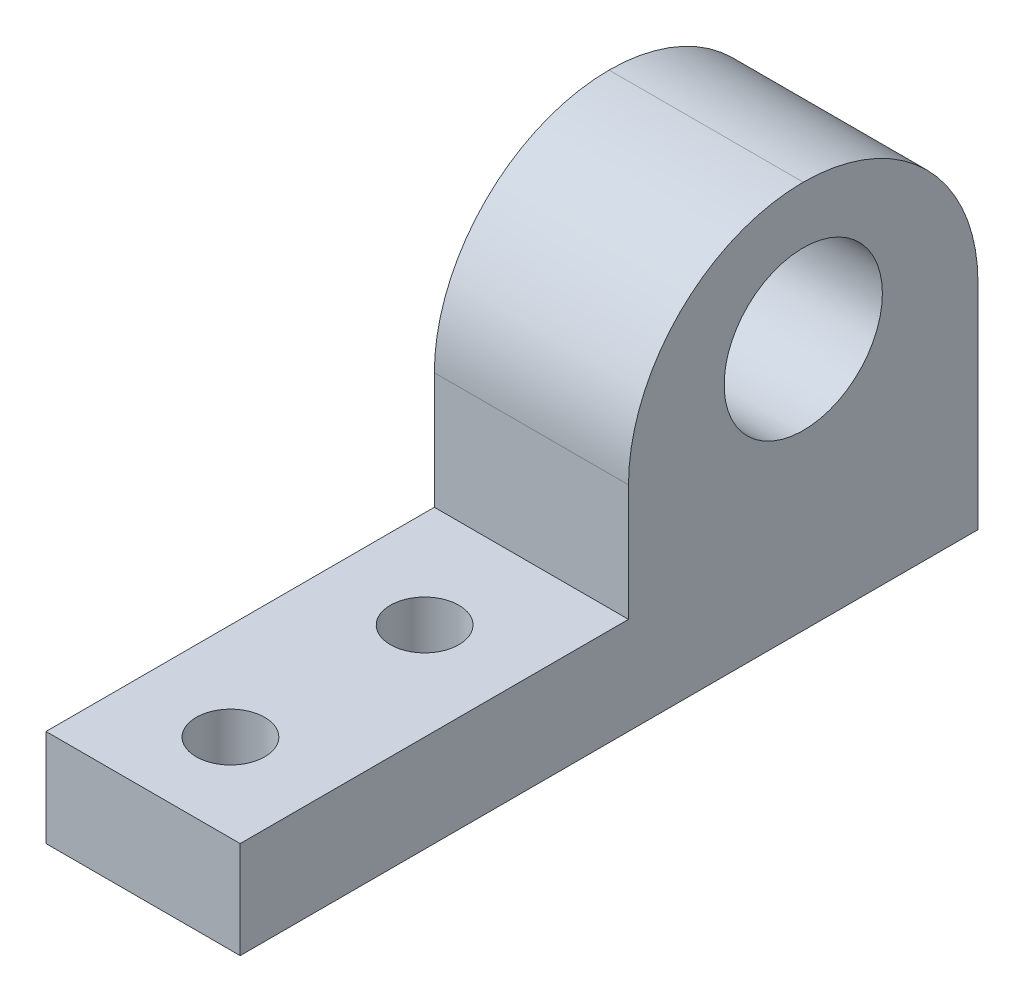
ISO-10303-21;
HEADER;
FILE_DESCRIPTION(('STEP AP214'),'2;1');
FILE_NAME('part.step','',(''),(''),'','','');
FILE_SCHEMA(('AUTOMOTIVE_DESIGN { 1 0 10303 214 1 1 1 1 }'));
ENDSEC;
DATA;
#1=APPLICATION_CONTEXT('core data for automotive mechanical design processes');
#2=APPLICATION_PROTOCOL_DEFINITION('international standard','automotive_design',2000,#1);
#3=PRODUCT_CONTEXT('',#1,'mechanical');
#4=PRODUCT('Part','Part','',(#3));
#5=PRODUCT_RELATED_PRODUCT_CATEGORY('part','',(#4));
#6=PRODUCT_DEFINITION_FORMATION('','',#4);
#7=PRODUCT_DEFINITION_CONTEXT('part definition',#1,'design');
#8=PRODUCT_DEFINITION('design','',#6,#7);
#9=PRODUCT_DEFINITION_SHAPE('','',#8);
#10=(LENGTH_UNIT() NAMED_UNIT(*) SI_UNIT(.MILLI.,.METRE.));
#11=(NAMED_UNIT(*) PLANE_ANGLE_UNIT() SI_UNIT($,.RADIAN.));
#12=(NAMED_UNIT(*) SI_UNIT($,.STERADIAN.) SOLID_ANGLE_UNIT());
#13=UNCERTAINTY_MEASURE_WITH_UNIT(LENGTH_MEASURE(1.E-05),#10,'distance_accuracy_value','');
#14=(GEOMETRIC_REPRESENTATION_CONTEXT(3) GLOBAL_UNCERTAINTY_ASSIGNED_CONTEXT((#13)) GLOBAL_UNIT_ASSIGNED_CONTEXT((#10,
#11,#12)) REPRESENTATION_CONTEXT('',''));
#15=CARTESIAN_POINT('',(0.,0.,0.));
#16=DIRECTION('',(0.,0.,1.));
#17=DIRECTION('',(1.,0.,0.));
#18=AXIS2_PLACEMENT_3D('',#15,#16,#17);
#19=CARTESIAN_POINT('',(0.,5.,0.));
#20=DIRECTION('',(0.,-1.,0.));
#21=DIRECTION('',(0.,0.,-1.));
#22=AXIS2_PLACEMENT_3D('',#19,#20,#21);
#23=PLANE('',#22);
#24=CARTESIAN_POINT('',(-2.1891891891892,5.,16.9054054054054));
#25=DIRECTION('',(0.,1.,0.));
#26=DIRECTION('',(0.,0.,1.));
#27=AXIS2_PLACEMENT_3D('',#24,#25,#26);
#28=CIRCLE('',#27,1.76359605175625);
#29=CARTESIAN_POINT('',(-2.1891891891892,5.,18.6690014571617));
#30=VERTEX_POINT('',#29);
#31=EDGE_CURVE('E122',#30,#30,#28,.T.);
#32=ORIENTED_EDGE('',*,*,#31,.F.);
#33=EDGE_LOOP('',(#32));
#34=FACE_BOUND('',#33,.T.);
#35=CARTESIAN_POINT('',(-2.18918918918919,5.,26.9054054054054));
#36=DIRECTION('',(0.,1.,0.));
#37=DIRECTION('',(0.,0.,1.));
#38=AXIS2_PLACEMENT_3D('',#35,#36,#37);
#39=CIRCLE('',#38,1.76359605175625);
#40=CARTESIAN_POINT('',(-2.18918918918919,5.,28.6690014571617));
#41=VERTEX_POINT('',#40);
#42=EDGE_CURVE('E128',#41,#41,#39,.T.);
#43=ORIENTED_EDGE('',*,*,#42,.F.);
#44=EDGE_LOOP('',(#43));
#45=FACE_BOUND('',#44,.T.);
#46=DIRECTION('',(1.,0.,0.));
#47=VECTOR('',#46,1.);
#48=CARTESIAN_POINT('',(-7.1891891891892,5.,11.4054054054054));
#49=LINE('',#48,#47);
#50=CARTESIAN_POINT('',(-7.1891891891892,5.,11.4054054054054));
#51=VERTEX_POINT('',#50);
#52=CARTESIAN_POINT('',(2.8108108108108,5.,11.4054054054054));
#53=VERTEX_POINT('',#52);
#54=EDGE_CURVE('E103',#51,#53,#49,.T.);
#55=ORIENTED_EDGE('',*,*,#54,.F.);
#56=DIRECTION('',(0.,0.,1.));
#57=VECTOR('',#56,1.);
#58=CARTESIAN_POINT('',(-7.1891891891892,5.,-6.59459459459459));
#59=LINE('',#58,#57);
#60=CARTESIAN_POINT('',(-7.18918918918919,5.,31.4054054054054));
#61=VERTEX_POINT('',#60);
#62=EDGE_CURVE('E134',#51,#61,#59,.T.);
#63=ORIENTED_EDGE('',*,*,#62,.T.);
#64=DIRECTION('',(1.,0.,0.));
#65=VECTOR('',#64,1.);
#66=CARTESIAN_POINT('',(2.8108108108108,5.,31.4054054054054));
#67=LINE('',#66,#65);
#68=CARTESIAN_POINT('',(2.8108108108108,5.,31.4054054054054));
#69=VERTEX_POINT('',#68);
#70=EDGE_CURVE('E109',#61,#69,#67,.T.);
#71=ORIENTED_EDGE('',*,*,#70,.T.);
#72=DIRECTION('',(0.,0.,-1.));
#73=VECTOR('',#72,1.);
#74=CARTESIAN_POINT('',(2.8108108108108,5.,-6.59459459459459));
#75=LINE('',#74,#73);
#76=EDGE_CURVE('E95',#69,#53,#75,.T.);
#77=ORIENTED_EDGE('',*,*,#76,.T.);
#78=EDGE_LOOP('',(#55,#63,#71,#77));
#79=FACE_BOUND('',#78,.T.);
#80=ADVANCED_FACE('F35',(#34,#45,#79),#23,.F.);
#81=CARTESIAN_POINT('',(0.,0.,0.));
#82=DIRECTION('',(0.,-1.,0.));
#83=DIRECTION('',(0.,0.,-1.));
#84=AXIS2_PLACEMENT_3D('',#81,#82,#83);
#85=PLANE('',#84);
#86=CARTESIAN_POINT('',(-2.18918918918919,0.,26.9054054054054));
#87=DIRECTION('',(0.,1.,0.));
#88=DIRECTION('',(0.,0.,1.));
#89=AXIS2_PLACEMENT_3D('',#86,#87,#88);
#90=CIRCLE('',#89,1.76359605175625);
#91=CARTESIAN_POINT('',(-2.18918918918919,0.,28.6690014571617));
#92=VERTEX_POINT('',#91);
#93=EDGE_CURVE('E125',#92,#92,#90,.T.);
#94=ORIENTED_EDGE('',*,*,#93,.T.);
#95=EDGE_LOOP('',(#94));
#96=FACE_BOUND('',#95,.T.);
#97=DIRECTION('',(0.,0.,1.));
#98=VECTOR('',#97,1.);
#99=CARTESIAN_POINT('',(-7.1891891891892,0.,-6.59459459459459));
#100=LINE('',#99,#98);
#101=CARTESIAN_POINT('',(-7.1891891891892,0.,-6.59459459459459));
#102=VERTEX_POINT('',#101);
#103=CARTESIAN_POINT('',(-7.18918918918919,0.,31.4054054054054));
#104=VERTEX_POINT('',#103);
#105=EDGE_CURVE('E131',#102,#104,#100,.T.);
#106=ORIENTED_EDGE('',*,*,#105,.F.);
#107=DIRECTION('',(-1.,0.,0.));
#108=VECTOR('',#107,1.);
#109=CARTESIAN_POINT('',(-7.1891891891892,0.,-6.59459459459459));
#110=LINE('',#109,#108);
#111=CARTESIAN_POINT('',(2.8108108108108,0.,-6.59459459459459));
#112=VERTEX_POINT('',#111);
#113=EDGE_CURVE('E136',#112,#102,#110,.T.);
#114=ORIENTED_EDGE('',*,*,#113,.F.);
#115=DIRECTION('',(0.,0.,-1.));
#116=VECTOR('',#115,1.);
#117=CARTESIAN_POINT('',(2.8108108108108,0.,-6.59459459459459));
#118=LINE('',#117,#116);
#119=CARTESIAN_POINT('',(2.8108108108108,0.,31.4054054054054));
#120=VERTEX_POINT('',#119);
#121=EDGE_CURVE('E142',#120,#112,#118,.T.);
#122=ORIENTED_EDGE('',*,*,#121,.F.);
#123=DIRECTION('',(1.,0.,0.));
#124=VECTOR('',#123,1.);
#125=CARTESIAN_POINT('',(2.8108108108108,0.,31.4054054054054));
#126=LINE('',#125,#124);
#127=EDGE_CURVE('E140',#104,#120,#126,.T.);
#128=ORIENTED_EDGE('',*,*,#127,.F.);
#129=EDGE_LOOP('',(#106,#114,#122,#128));
#130=FACE_BOUND('',#129,.T.);
#131=CARTESIAN_POINT('',(-2.1891891891892,0.,16.9054054054054));
#132=DIRECTION('',(0.,1.,0.));
#133=DIRECTION('',(0.,0.,1.));
#134=AXIS2_PLACEMENT_3D('',#131,#132,#133);
#135=CIRCLE('',#134,1.76359605175625);
#136=CARTESIAN_POINT('',(-2.1891891891892,0.,18.6690014571617));
#137=VERTEX_POINT('',#136);
#138=EDGE_CURVE('E121',#137,#137,#135,.T.);
#139=ORIENTED_EDGE('',*,*,#138,.T.);
#140=EDGE_LOOP('',(#139));
#141=FACE_BOUND('',#140,.T.);
#142=ADVANCED_FACE('F171',(#96,#130,#141),#85,.T.);
#143=CARTESIAN_POINT('',(-7.1891891891892,5.,-6.59459459459459));
#144=DIRECTION('',(1.,0.,0.));
#145=DIRECTION('',(0.,0.,-1.));
#146=AXIS2_PLACEMENT_3D('',#143,#144,#145);
#147=PLANE('',#146);
#148=CARTESIAN_POINT('',(-7.1891891891892,13.,2.40540540540541));
#149=DIRECTION('',(1.,0.,0.));
#150=DIRECTION('',(0.,0.,-1.));
#151=AXIS2_PLACEMENT_3D('',#148,#149,#150);
#152=CIRCLE('',#151,4.075);
#153=CARTESIAN_POINT('',(-7.1891891891892,13.,-1.66959459459458));
#154=VERTEX_POINT('',#153);
#155=EDGE_CURVE('E116',#154,#154,#152,.T.);
#156=ORIENTED_EDGE('',*,*,#155,.T.);
#157=EDGE_LOOP('',(#156));
#158=FACE_BOUND('',#157,.T.);
#159=DIRECTION('',(0.,-1.,0.));
#160=VECTOR('',#159,1.);
#161=CARTESIAN_POINT('',(-7.1891891891892,20.,11.4054054054054));
#162=LINE('',#161,#160);
#163=CARTESIAN_POINT('',(-7.1891891891892,11.,11.4054054054054));
#164=VERTEX_POINT('',#163);
#165=EDGE_CURVE('E102',#164,#51,#162,.T.);
#166=ORIENTED_EDGE('',*,*,#165,.F.);
#167=CARTESIAN_POINT('',(-7.1891891891892,11.,2.40540540540541));
#168=DIRECTION('',(1.,0.,0.));
#169=DIRECTION('',(0.,0.,-1.));
#170=AXIS2_PLACEMENT_3D('',#167,#168,#169);
#171=CIRCLE('',#170,9.);
#172=CARTESIAN_POINT('',(-7.1891891891892,20.,2.40540540540541));
#173=VERTEX_POINT('',#172);
#174=EDGE_CURVE('E44',#164,#173,#171,.F.);
#175=ORIENTED_EDGE('',*,*,#174,.T.);
#176=CARTESIAN_POINT('',(-7.1891891891892,11.,2.40540540540541));
#177=DIRECTION('',(1.,0.,0.));
#178=DIRECTION('',(0.,0.,-1.));
#179=AXIS2_PLACEMENT_3D('',#176,#177,#178);
#180=CIRCLE('',#179,9.);
#181=CARTESIAN_POINT('',(-7.1891891891892,11.,-6.59459459459459));
#182=VERTEX_POINT('',#181);
#183=EDGE_CURVE('E51',#173,#182,#180,.F.);
#184=ORIENTED_EDGE('',*,*,#183,.T.);
#185=DIRECTION('',(0.,-1.,0.));
#186=VECTOR('',#185,1.);
#187=CARTESIAN_POINT('',(-7.1891891891892,5.,-6.59459459459459));
#188=LINE('',#187,#186);
#189=EDGE_CURVE('E111',#182,#102,#188,.T.);
#190=ORIENTED_EDGE('',*,*,#189,.T.);
#191=ORIENTED_EDGE('',*,*,#105,.T.);
#192=DIRECTION('',(0.,-1.,0.));
#193=VECTOR('',#192,1.);
#194=CARTESIAN_POINT('',(-7.18918918918919,5.,31.4054054054054));
#195=LINE('',#194,#193);
#196=EDGE_CURVE('E152',#61,#104,#195,.T.);
#197=ORIENTED_EDGE('',*,*,#196,.F.);
#198=ORIENTED_EDGE('',*,*,#62,.F.);
#199=EDGE_LOOP('',(#166,#175,#184,#190,#191,#197,#198));
#200=FACE_BOUND('',#199,.T.);
#201=ADVANCED_FACE('F162',(#158,#200),#147,.F.);
#202=CARTESIAN_POINT('',(2.8108108108108,5.,31.4054054054054));
#203=DIRECTION('',(0.,0.,-1.));
#204=DIRECTION('',(-1.,0.,0.));
#205=AXIS2_PLACEMENT_3D('',#202,#203,#204);
#206=PLANE('',#205);
#207=ORIENTED_EDGE('',*,*,#127,.T.);
#208=DIRECTION('',(0.,-1.,0.));
#209=VECTOR('',#208,1.);
#210=CARTESIAN_POINT('',(2.8108108108108,5.,31.4054054054054));
#211=LINE('',#210,#209);
#212=EDGE_CURVE('E150',#69,#120,#211,.T.);
#213=ORIENTED_EDGE('',*,*,#212,.F.);
#214=ORIENTED_EDGE('',*,*,#70,.F.);
#215=ORIENTED_EDGE('',*,*,#196,.T.);
#216=EDGE_LOOP('',(#207,#213,#214,#215));
#217=FACE_BOUND('',#216,.T.);
#218=ADVANCED_FACE('F165',(#217),#206,.F.);
#219=CARTESIAN_POINT('',(2.8108108108108,5.,-6.59459459459459));
#220=DIRECTION('',(-1.,0.,0.));
#221=DIRECTION('',(0.,0.,1.));
#222=AXIS2_PLACEMENT_3D('',#219,#220,#221);
#223=PLANE('',#222);
#224=CARTESIAN_POINT('',(2.8108108108108,13.,2.40540540540541));
#225=DIRECTION('',(1.,0.,0.));
#226=DIRECTION('',(0.,0.,-1.));
#227=AXIS2_PLACEMENT_3D('',#224,#225,#226);
#228=CIRCLE('',#227,4.075);
#229=CARTESIAN_POINT('',(2.8108108108108,13.,-1.66959459459459));
#230=VERTEX_POINT('',#229);
#231=EDGE_CURVE('E216',#230,#230,#228,.T.);
#232=ORIENTED_EDGE('',*,*,#231,.F.);
#233=EDGE_LOOP('',(#232));
#234=FACE_BOUND('',#233,.T.);
#235=CARTESIAN_POINT('',(2.8108108108108,11.,2.40540540540541));
#236=DIRECTION('',(-1.,0.,0.));
#237=DIRECTION('',(0.,0.,1.));
#238=AXIS2_PLACEMENT_3D('',#235,#236,#237);
#239=CIRCLE('',#238,9.);
#240=CARTESIAN_POINT('',(2.8108108108108,11.,-6.59459459459459));
#241=VERTEX_POINT('',#240);
#242=CARTESIAN_POINT('',(2.8108108108108,20.,2.40540540540541));
#243=VERTEX_POINT('',#242);
#244=EDGE_CURVE('E155',#241,#243,#239,.F.);
#245=ORIENTED_EDGE('',*,*,#244,.T.);
#246=CARTESIAN_POINT('',(2.8108108108108,11.,2.40540540540541));
#247=DIRECTION('',(-1.,0.,0.));
#248=DIRECTION('',(0.,0.,1.));
#249=AXIS2_PLACEMENT_3D('',#246,#247,#248);
#250=CIRCLE('',#249,9.);
#251=CARTESIAN_POINT('',(2.8108108108108,11.,11.4054054054054));
#252=VERTEX_POINT('',#251);
#253=EDGE_CURVE('E97',#243,#252,#250,.F.);
#254=ORIENTED_EDGE('',*,*,#253,.T.);
#255=DIRECTION('',(0.,-1.,0.));
#256=VECTOR('',#255,1.);
#257=CARTESIAN_POINT('',(2.8108108108108,20.,11.4054054054054));
#258=LINE('',#257,#256);
#259=EDGE_CURVE('E91',#252,#53,#258,.T.);
#260=ORIENTED_EDGE('',*,*,#259,.T.);
#261=ORIENTED_EDGE('',*,*,#76,.F.);
#262=ORIENTED_EDGE('',*,*,#212,.T.);
#263=ORIENTED_EDGE('',*,*,#121,.T.);
#264=DIRECTION('',(0.,-1.,0.));
#265=VECTOR('',#264,1.);
#266=CARTESIAN_POINT('',(2.8108108108108,5.,-6.59459459459459));
#267=LINE('',#266,#265);
#268=EDGE_CURVE('E148',#241,#112,#267,.T.);
#269=ORIENTED_EDGE('',*,*,#268,.F.);
#270=EDGE_LOOP('',(#245,#254,#260,#261,#262,#263,#269));
#271=FACE_BOUND('',#270,.T.);
#272=ADVANCED_FACE('F93',(#234,#271),#223,.F.);
#273=CARTESIAN_POINT('',(-7.1891891891892,5.,-6.59459459459459));
#274=DIRECTION('',(0.,0.,1.));
#275=DIRECTION('',(1.,0.,0.));
#276=AXIS2_PLACEMENT_3D('',#273,#274,#275);
#277=PLANE('',#276);
#278=ORIENTED_EDGE('',*,*,#189,.F.);
#279=DIRECTION('',(-1.,0.,0.));
#280=VECTOR('',#279,1.);
#281=CARTESIAN_POINT('',(2.8108108108108,11.,-6.59459459459459));
#282=LINE('',#281,#280);
#283=EDGE_CURVE('E11',#182,#241,#282,.F.);
#284=ORIENTED_EDGE('',*,*,#283,.T.);
#285=ORIENTED_EDGE('',*,*,#268,.T.);
#286=ORIENTED_EDGE('',*,*,#113,.T.);
#287=EDGE_LOOP('',(#278,#284,#285,#286));
#288=FACE_BOUND('',#287,.T.);
#289=ADVANCED_FACE('F174',(#288),#277,.F.);
#290=CARTESIAN_POINT('',(-2.18918918918919,5.,26.9054054054054));
#291=DIRECTION('',(0.,-1.,0.));
#292=DIRECTION('',(0.,0.,-1.));
#293=AXIS2_PLACEMENT_3D('',#290,#291,#292);
#294=CYLINDRICAL_SURFACE('',#293,1.76359605175625);
#295=ORIENTED_EDGE('',*,*,#42,.T.);
#296=EDGE_LOOP('',(#295));
#297=FACE_BOUND('',#296,.T.);
#298=ORIENTED_EDGE('',*,*,#93,.F.);
#299=EDGE_LOOP('',(#298));
#300=FACE_BOUND('',#299,.T.);
#301=ADVANCED_FACE('F200',(#297,#300),#294,.F.);
#302=CARTESIAN_POINT('',(-2.1891891891892,5.,16.9054054054054));
#303=DIRECTION('',(0.,-1.,0.));
#304=DIRECTION('',(0.,0.,-1.));
#305=AXIS2_PLACEMENT_3D('',#302,#303,#304);
#306=CYLINDRICAL_SURFACE('',#305,1.76359605175625);
#307=ORIENTED_EDGE('',*,*,#31,.T.);
#308=EDGE_LOOP('',(#307));
#309=FACE_BOUND('',#308,.T.);
#310=ORIENTED_EDGE('',*,*,#138,.F.);
#311=EDGE_LOOP('',(#310));
#312=FACE_BOUND('',#311,.T.);
#313=ADVANCED_FACE('F241',(#309,#312),#306,.F.);
#314=CARTESIAN_POINT('',(-7.1891891891892,20.,11.4054054054054));
#315=DIRECTION('',(0.,0.,-1.));
#316=DIRECTION('',(-1.,0.,0.));
#317=AXIS2_PLACEMENT_3D('',#314,#315,#316);
#318=PLANE('',#317);
#319=ORIENTED_EDGE('',*,*,#259,.F.);
#320=DIRECTION('',(1.,0.,0.));
#321=VECTOR('',#320,1.);
#322=CARTESIAN_POINT('',(-7.1891891891892,11.,11.4054054054054));
#323=LINE('',#322,#321);
#324=EDGE_CURVE('E158',#252,#164,#323,.F.);
#325=ORIENTED_EDGE('',*,*,#324,.T.);
#326=ORIENTED_EDGE('',*,*,#165,.T.);
#327=ORIENTED_EDGE('',*,*,#54,.T.);
#328=EDGE_LOOP('',(#319,#325,#326,#327));
#329=FACE_BOUND('',#328,.T.);
#330=ADVANCED_FACE('F113',(#329),#318,.F.);
#331=CARTESIAN_POINT('',(0.,11.,2.40540540540541));
#332=DIRECTION('',(1.,0.,0.));
#333=DIRECTION('',(0.,0.,-1.));
#334=AXIS2_PLACEMENT_3D('',#331,#332,#333);
#335=CYLINDRICAL_SURFACE('',#334,9.);
#336=ORIENTED_EDGE('',*,*,#283,.F.);
#337=ORIENTED_EDGE('',*,*,#183,.F.);
#338=DIRECTION('',(-1.,0.,0.));
#339=VECTOR('',#338,1.);
#340=CARTESIAN_POINT('',(-7.1891891891892,20.,2.40540540540541));
#341=LINE('',#340,#339);
#342=EDGE_CURVE('E39',#243,#173,#341,.T.);
#343=ORIENTED_EDGE('',*,*,#342,.F.);
#344=ORIENTED_EDGE('',*,*,#244,.F.);
#345=EDGE_LOOP('',(#336,#337,#343,#344));
#346=FACE_BOUND('',#345,.T.);
#347=ADVANCED_FACE('F37',(#346),#335,.T.);
#348=CARTESIAN_POINT('',(0.,11.,2.40540540540541));
#349=DIRECTION('',(-1.,0.,0.));
#350=DIRECTION('',(0.,0.,1.));
#351=AXIS2_PLACEMENT_3D('',#348,#349,#350);
#352=CYLINDRICAL_SURFACE('',#351,9.);
#353=ORIENTED_EDGE('',*,*,#174,.F.);
#354=ORIENTED_EDGE('',*,*,#324,.F.);
#355=ORIENTED_EDGE('',*,*,#253,.F.);
#356=ORIENTED_EDGE('',*,*,#342,.T.);
#357=EDGE_LOOP('',(#353,#354,#355,#356));
#358=FACE_BOUND('',#357,.T.);
#359=ADVANCED_FACE('F179',(#358),#352,.T.);
#360=CARTESIAN_POINT('',(-17.1891891891892,13.,2.40540540540542));
#361=DIRECTION('',(1.,0.,0.));
#362=DIRECTION('',(0.,0.,-1.));
#363=AXIS2_PLACEMENT_3D('',#360,#361,#362);
#364=CYLINDRICAL_SURFACE('',#363,4.075);
#365=ORIENTED_EDGE('',*,*,#231,.T.);
#366=EDGE_LOOP('',(#365));
#367=FACE_BOUND('',#366,.T.);
#368=ORIENTED_EDGE('',*,*,#155,.F.);
#369=EDGE_LOOP('',(#368));
#370=FACE_BOUND('',#369,.T.);
#371=ADVANCED_FACE('F181',(#367,#370),#364,.F.);
#372=CLOSED_SHELL('',(#80,#142,#201,#218,#272,#289,#301,#313,#330,#347,#359,#371));
#373=MANIFOLD_SOLID_BREP('B2',#372);
#374=ADVANCED_BREP_SHAPE_REPRESENTATION('',(#18,#373),#14);
#375=SHAPE_DEFINITION_REPRESENTATION(#9,#374);
ENDSEC;
END-ISO-10303-21;
